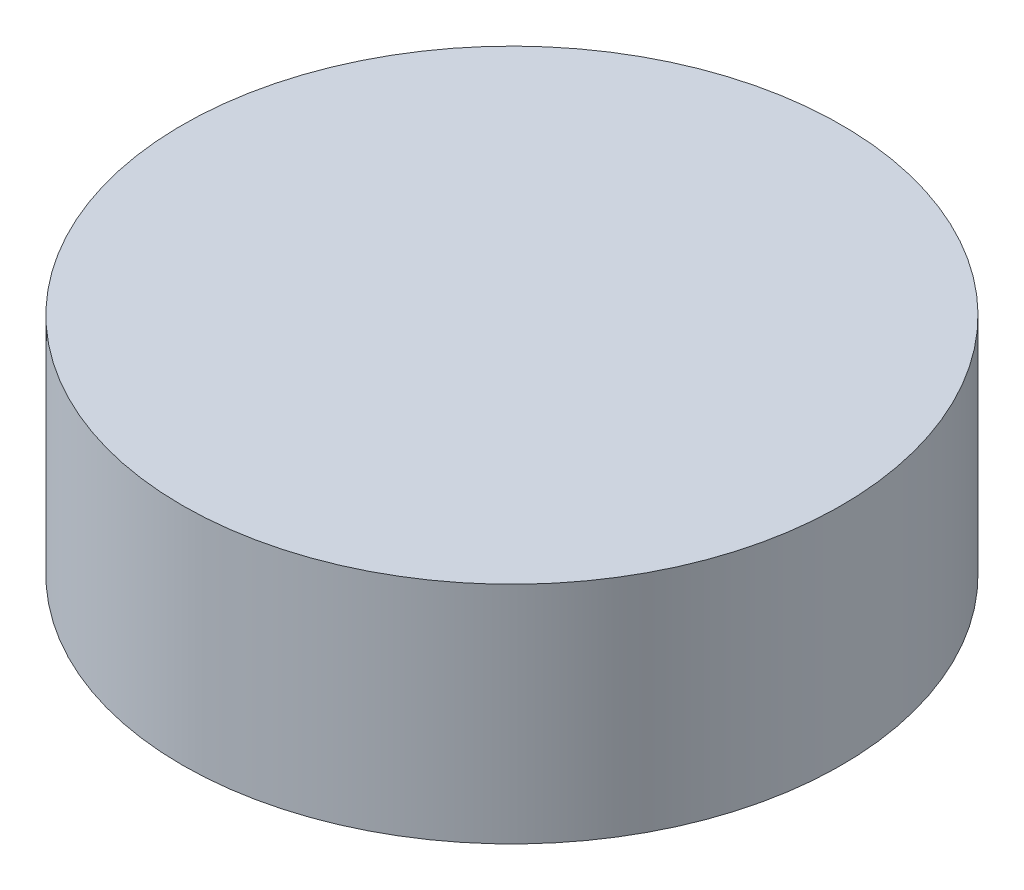
ISO-10303-21;
HEADER;
FILE_DESCRIPTION(('STEP AP214'),'2;1');
FILE_NAME('part.step','',(''),(''),'','','');
FILE_SCHEMA(('AUTOMOTIVE_DESIGN { 1 0 10303 214 1 1 1 1 }'));
ENDSEC;
DATA;
#1=APPLICATION_CONTEXT('core data for automotive mechanical design processes');
#2=APPLICATION_PROTOCOL_DEFINITION('international standard','automotive_design',2000,#1);
#3=PRODUCT_CONTEXT('',#1,'mechanical');
#4=PRODUCT('Part','Part','',(#3));
#5=PRODUCT_RELATED_PRODUCT_CATEGORY('part','',(#4));
#6=PRODUCT_DEFINITION_FORMATION('','',#4);
#7=PRODUCT_DEFINITION_CONTEXT('part definition',#1,'design');
#8=PRODUCT_DEFINITION('design','',#6,#7);
#9=PRODUCT_DEFINITION_SHAPE('','',#8);
#10=(LENGTH_UNIT() NAMED_UNIT(*) SI_UNIT(.MILLI.,.METRE.));
#11=(NAMED_UNIT(*) PLANE_ANGLE_UNIT() SI_UNIT($,.RADIAN.));
#12=(NAMED_UNIT(*) SI_UNIT($,.STERADIAN.) SOLID_ANGLE_UNIT());
#13=UNCERTAINTY_MEASURE_WITH_UNIT(LENGTH_MEASURE(1.E-05),#10,'distance_accuracy_value','');
#14=(GEOMETRIC_REPRESENTATION_CONTEXT(3) GLOBAL_UNCERTAINTY_ASSIGNED_CONTEXT((#13)) GLOBAL_UNIT_ASSIGNED_CONTEXT((#10,
#11,#12)) REPRESENTATION_CONTEXT('',''));
#15=CARTESIAN_POINT('',(0.,0.,0.));
#16=DIRECTION('',(0.,0.,1.));
#17=DIRECTION('',(1.,0.,0.));
#18=AXIS2_PLACEMENT_3D('',#15,#16,#17);
#19=CARTESIAN_POINT('',(0.,13.,0.));
#20=DIRECTION('',(0.,-1.,0.));
#21=DIRECTION('',(0.,0.,-1.));
#22=AXIS2_PLACEMENT_3D('',#19,#20,#21);
#23=CYLINDRICAL_SURFACE('',#22,19.05);
#24=CARTESIAN_POINT('',(0.,13.,0.));
#25=DIRECTION('',(0.,1.,0.));
#26=DIRECTION('',(0.,0.,1.));
#27=AXIS2_PLACEMENT_3D('',#24,#25,#26);
#28=CIRCLE('',#27,19.05);
#29=CARTESIAN_POINT('',(0.,13.,19.05));
#30=VERTEX_POINT('',#29);
#31=EDGE_CURVE('E10',#30,#30,#28,.T.);
#32=ORIENTED_EDGE('',*,*,#31,.F.);
#33=EDGE_LOOP('',(#32));
#34=FACE_BOUND('',#33,.T.);
#35=CARTESIAN_POINT('',(0.,0.,0.));
#36=DIRECTION('',(0.,1.,0.));
#37=DIRECTION('',(0.,0.,1.));
#38=AXIS2_PLACEMENT_3D('',#35,#36,#37);
#39=CIRCLE('',#38,19.05);
#40=CARTESIAN_POINT('',(0.,0.,19.05));
#41=VERTEX_POINT('',#40);
#42=EDGE_CURVE('E33',#41,#41,#39,.T.);
#43=ORIENTED_EDGE('',*,*,#42,.T.);
#44=EDGE_LOOP('',(#43));
#45=FACE_BOUND('',#44,.T.);
#46=ADVANCED_FACE('F30',(#34,#45),#23,.T.);
#47=CARTESIAN_POINT('',(0.,13.,0.));
#48=DIRECTION('',(0.,1.,0.));
#49=DIRECTION('',(0.,0.,1.));
#50=AXIS2_PLACEMENT_3D('',#47,#48,#49);
#51=PLANE('',#50);
#52=ORIENTED_EDGE('',*,*,#31,.T.);
#53=EDGE_LOOP('',(#52));
#54=FACE_BOUND('',#53,.T.);
#55=ADVANCED_FACE('F59',(#54),#51,.T.);
#56=CARTESIAN_POINT('',(0.,0.,0.));
#57=DIRECTION('',(0.,1.,0.));
#58=DIRECTION('',(0.,0.,1.));
#59=AXIS2_PLACEMENT_3D('',#56,#57,#58);
#60=PLANE('',#59);
#61=CARTESIAN_POINT('',(0.,0.,0.));
#62=DIRECTION('',(0.,-1.,0.));
#63=DIRECTION('',(0.,0.,-1.));
#64=AXIS2_PLACEMENT_3D('',#61,#62,#63);
#65=CIRCLE('',#64,10.126999939);
#66=CARTESIAN_POINT('',(0.,0.,-10.126999939));
#67=VERTEX_POINT('',#66);
#68=EDGE_CURVE('E42',#67,#67,#65,.T.);
#69=ORIENTED_EDGE('',*,*,#68,.F.);
#70=EDGE_LOOP('',(#69));
#71=FACE_BOUND('',#70,.T.);
#72=ORIENTED_EDGE('',*,*,#42,.F.);
#73=EDGE_LOOP('',(#72));
#74=FACE_BOUND('',#73,.T.);
#75=ADVANCED_FACE('F53',(#71,#74),#60,.F.);
#76=CARTESIAN_POINT('',(0.,8.,0.));
#77=DIRECTION('',(0.,-1.,0.));
#78=DIRECTION('',(0.,0.,-1.));
#79=AXIS2_PLACEMENT_3D('',#76,#77,#78);
#80=CYLINDRICAL_SURFACE('',#79,10.126999939);
#81=CARTESIAN_POINT('',(0.,8.,0.));
#82=DIRECTION('',(0.,-1.,0.));
#83=DIRECTION('',(0.,0.,-1.));
#84=AXIS2_PLACEMENT_3D('',#81,#82,#83);
#85=CIRCLE('',#84,10.126999939);
#86=CARTESIAN_POINT('',(0.,8.,-10.126999939));
#87=VERTEX_POINT('',#86);
#88=EDGE_CURVE('E40',#87,#87,#85,.T.);
#89=ORIENTED_EDGE('',*,*,#88,.F.);
#90=EDGE_LOOP('',(#89));
#91=FACE_BOUND('',#90,.T.);
#92=ORIENTED_EDGE('',*,*,#68,.T.);
#93=EDGE_LOOP('',(#92));
#94=FACE_BOUND('',#93,.T.);
#95=ADVANCED_FACE('F50',(#91,#94),#80,.F.);
#96=CARTESIAN_POINT('',(0.,8.,0.));
#97=DIRECTION('',(0.,-1.,0.));
#98=DIRECTION('',(0.,0.,-1.));
#99=AXIS2_PLACEMENT_3D('',#96,#97,#98);
#100=PLANE('',#99);
#101=ORIENTED_EDGE('',*,*,#88,.T.);
#102=EDGE_LOOP('',(#101));
#103=FACE_BOUND('',#102,.T.);
#104=ADVANCED_FACE('F48',(#103),#100,.T.);
#105=CLOSED_SHELL('',(#46,#55,#75,#95,#104));
#106=MANIFOLD_SOLID_BREP('B2',#105);
#107=ADVANCED_BREP_SHAPE_REPRESENTATION('',(#18,#106),#14);
#108=SHAPE_DEFINITION_REPRESENTATION(#9,#107);
ENDSEC;
END-ISO-10303-21;
